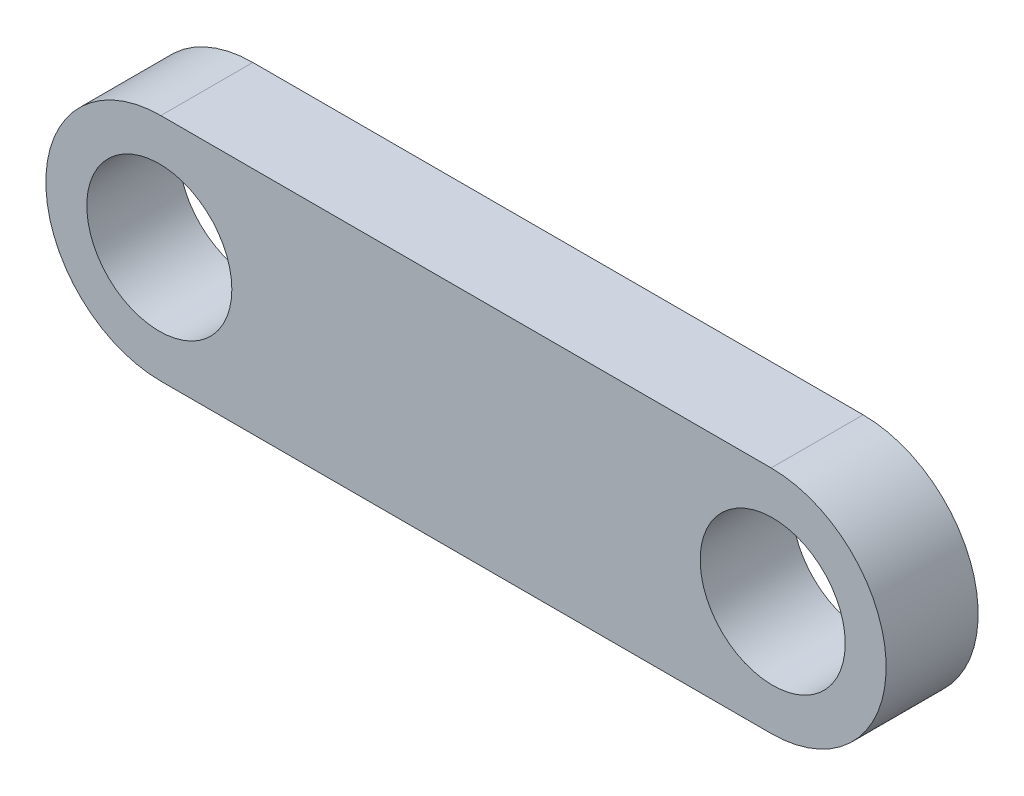
ISO-10303-21;
HEADER;
FILE_DESCRIPTION(('STEP AP214'),'2;1');
FILE_NAME('part.step','',(''),(''),'','','');
FILE_SCHEMA(('AUTOMOTIVE_DESIGN { 1 0 10303 214 1 1 1 1 }'));
ENDSEC;
DATA;
#1=APPLICATION_CONTEXT('core data for automotive mechanical design processes');
#2=APPLICATION_PROTOCOL_DEFINITION('international standard','automotive_design',2000,#1);
#3=PRODUCT_CONTEXT('',#1,'mechanical');
#4=PRODUCT('Part','Part','',(#3));
#5=PRODUCT_RELATED_PRODUCT_CATEGORY('part','',(#4));
#6=PRODUCT_DEFINITION_FORMATION('','',#4);
#7=PRODUCT_DEFINITION_CONTEXT('part definition',#1,'design');
#8=PRODUCT_DEFINITION('design','',#6,#7);
#9=PRODUCT_DEFINITION_SHAPE('','',#8);
#10=(LENGTH_UNIT() NAMED_UNIT(*) SI_UNIT(.MILLI.,.METRE.));
#11=(NAMED_UNIT(*) PLANE_ANGLE_UNIT() SI_UNIT($,.RADIAN.));
#12=(NAMED_UNIT(*) SI_UNIT($,.STERADIAN.) SOLID_ANGLE_UNIT());
#13=UNCERTAINTY_MEASURE_WITH_UNIT(LENGTH_MEASURE(1.E-05),#10,'distance_accuracy_value','');
#14=(GEOMETRIC_REPRESENTATION_CONTEXT(3) GLOBAL_UNCERTAINTY_ASSIGNED_CONTEXT((#13)) GLOBAL_UNIT_ASSIGNED_CONTEXT((#10,
#11,#12)) REPRESENTATION_CONTEXT('',''));
#15=CARTESIAN_POINT('',(0.,0.,0.));
#16=DIRECTION('',(0.,0.,1.));
#17=DIRECTION('',(1.,0.,0.));
#18=AXIS2_PLACEMENT_3D('',#15,#16,#17);
#19=CARTESIAN_POINT('',(0.049999999999998,-3.75,-28.4079214304743));
#20=DIRECTION('',(0.,-1.,0.));
#21=DIRECTION('',(0.,0.,-1.));
#22=AXIS2_PLACEMENT_3D('',#19,#20,#21);
#23=PLANE('',#22);
#24=DIRECTION('',(-1.,0.,0.));
#25=VECTOR('',#24,1.);
#26=CARTESIAN_POINT('',(0.049999999999998,-3.75,0.));
#27=LINE('',#26,#25);
#28=CARTESIAN_POINT('',(19.95,-3.75,0.));
#29=VERTEX_POINT('',#28);
#30=CARTESIAN_POINT('',(0.049999999999998,-3.75,0.));
#31=VERTEX_POINT('',#30);
#32=EDGE_CURVE('E121',#29,#31,#27,.T.);
#33=ORIENTED_EDGE('',*,*,#32,.F.);
#34=DIRECTION('',(0.,0.,1.));
#35=VECTOR('',#34,1.);
#36=CARTESIAN_POINT('',(19.95,-3.75,-28.4079214304743));
#37=LINE('',#36,#35);
#38=CARTESIAN_POINT('',(19.95,-3.75,3.));
#39=VERTEX_POINT('',#38);
#40=EDGE_CURVE('E87',#29,#39,#37,.T.);
#41=ORIENTED_EDGE('',*,*,#40,.T.);
#42=DIRECTION('',(1.,0.,0.));
#43=VECTOR('',#42,1.);
#44=CARTESIAN_POINT('',(0.049999999999998,-3.75,3.));
#45=LINE('',#44,#43);
#46=CARTESIAN_POINT('',(0.049999999999998,-3.75,3.));
#47=VERTEX_POINT('',#46);
#48=EDGE_CURVE('E90',#47,#39,#45,.T.);
#49=ORIENTED_EDGE('',*,*,#48,.F.);
#50=DIRECTION('',(0.,0.,1.));
#51=VECTOR('',#50,1.);
#52=CARTESIAN_POINT('',(0.049999999999998,-3.75,-28.4079214304743));
#53=LINE('',#52,#51);
#54=EDGE_CURVE('E78',#31,#47,#53,.T.);
#55=ORIENTED_EDGE('',*,*,#54,.F.);
#56=EDGE_LOOP('',(#33,#41,#49,#55));
#57=FACE_BOUND('',#56,.T.);
#58=ADVANCED_FACE('F40',(#57),#23,.T.);
#59=CARTESIAN_POINT('',(19.95,0.,-28.4079214304743));
#60=DIRECTION('',(0.,0.,1.));
#61=DIRECTION('',(1.,0.,0.));
#62=AXIS2_PLACEMENT_3D('',#59,#60,#61);
#63=CYLINDRICAL_SURFACE('',#62,3.75);
#64=CARTESIAN_POINT('',(19.95,0.,0.));
#65=DIRECTION('',(0.,0.,1.));
#66=DIRECTION('',(1.,0.,0.));
#67=AXIS2_PLACEMENT_3D('',#64,#65,#66);
#68=CIRCLE('',#67,3.75);
#69=CARTESIAN_POINT('',(19.95,3.75,0.));
#70=VERTEX_POINT('',#69);
#71=EDGE_CURVE('E110',#70,#29,#68,.F.);
#72=ORIENTED_EDGE('',*,*,#71,.F.);
#73=DIRECTION('',(0.,0.,1.));
#74=VECTOR('',#73,1.);
#75=CARTESIAN_POINT('',(19.95,3.75,-28.4079214304743));
#76=LINE('',#75,#74);
#77=CARTESIAN_POINT('',(19.95,3.75,3.));
#78=VERTEX_POINT('',#77);
#79=EDGE_CURVE('E111',#70,#78,#76,.T.);
#80=ORIENTED_EDGE('',*,*,#79,.T.);
#81=CARTESIAN_POINT('',(19.95,0.,3.));
#82=DIRECTION('',(0.,0.,1.));
#83=DIRECTION('',(1.,0.,0.));
#84=AXIS2_PLACEMENT_3D('',#81,#82,#83);
#85=CIRCLE('',#84,3.75);
#86=EDGE_CURVE('E95',#39,#78,#85,.T.);
#87=ORIENTED_EDGE('',*,*,#86,.F.);
#88=ORIENTED_EDGE('',*,*,#40,.F.);
#89=EDGE_LOOP('',(#72,#80,#87,#88));
#90=FACE_BOUND('',#89,.T.);
#91=ADVANCED_FACE('F116',(#90),#63,.T.);
#92=CARTESIAN_POINT('',(0.0499999999999987,3.75,-28.4079214304743));
#93=DIRECTION('',(0.,1.,0.));
#94=DIRECTION('',(0.,0.,1.));
#95=AXIS2_PLACEMENT_3D('',#92,#93,#94);
#96=PLANE('',#95);
#97=DIRECTION('',(1.,0.,0.));
#98=VECTOR('',#97,1.);
#99=CARTESIAN_POINT('',(0.0499999999999987,3.75,0.));
#100=LINE('',#99,#98);
#101=CARTESIAN_POINT('',(0.0499999999999987,3.75,0.));
#102=VERTEX_POINT('',#101);
#103=EDGE_CURVE('E119',#102,#70,#100,.T.);
#104=ORIENTED_EDGE('',*,*,#103,.F.);
#105=DIRECTION('',(0.,0.,1.));
#106=VECTOR('',#105,1.);
#107=CARTESIAN_POINT('',(0.0499999999999987,3.75,-28.4079214304743));
#108=LINE('',#107,#106);
#109=CARTESIAN_POINT('',(0.0499999999999987,3.75,3.));
#110=VERTEX_POINT('',#109);
#111=EDGE_CURVE('E108',#102,#110,#108,.T.);
#112=ORIENTED_EDGE('',*,*,#111,.T.);
#113=DIRECTION('',(-1.,0.,0.));
#114=VECTOR('',#113,1.);
#115=CARTESIAN_POINT('',(0.0499999999999987,3.75,3.));
#116=LINE('',#115,#114);
#117=EDGE_CURVE('E88',#78,#110,#116,.T.);
#118=ORIENTED_EDGE('',*,*,#117,.F.);
#119=ORIENTED_EDGE('',*,*,#79,.F.);
#120=EDGE_LOOP('',(#104,#112,#118,#119));
#121=FACE_BOUND('',#120,.T.);
#122=ADVANCED_FACE('F118',(#121),#96,.T.);
#123=CARTESIAN_POINT('',(0.0499999999999987,0.,-28.4079214304743));
#124=DIRECTION('',(0.,0.,1.));
#125=DIRECTION('',(1.,0.,0.));
#126=AXIS2_PLACEMENT_3D('',#123,#124,#125);
#127=CYLINDRICAL_SURFACE('',#126,3.75);
#128=CARTESIAN_POINT('',(0.0499999999999987,0.,0.));
#129=DIRECTION('',(0.,0.,1.));
#130=DIRECTION('',(1.,0.,0.));
#131=AXIS2_PLACEMENT_3D('',#128,#129,#130);
#132=CIRCLE('',#131,3.75);
#133=EDGE_CURVE('E58',#31,#102,#132,.F.);
#134=ORIENTED_EDGE('',*,*,#133,.F.);
#135=ORIENTED_EDGE('',*,*,#54,.T.);
#136=CARTESIAN_POINT('',(0.0499999999999987,0.,3.));
#137=DIRECTION('',(0.,0.,1.));
#138=DIRECTION('',(1.,0.,0.));
#139=AXIS2_PLACEMENT_3D('',#136,#137,#138);
#140=CIRCLE('',#139,3.75);
#141=EDGE_CURVE('E83',#110,#47,#140,.T.);
#142=ORIENTED_EDGE('',*,*,#141,.F.);
#143=ORIENTED_EDGE('',*,*,#111,.F.);
#144=EDGE_LOOP('',(#134,#135,#142,#143));
#145=FACE_BOUND('',#144,.T.);
#146=ADVANCED_FACE('F80',(#145),#127,.T.);
#147=CARTESIAN_POINT('',(0.,0.,0.));
#148=DIRECTION('',(0.,0.,1.));
#149=DIRECTION('',(1.,0.,0.));
#150=AXIS2_PLACEMENT_3D('',#147,#148,#149);
#151=PLANE('',#150);
#152=CARTESIAN_POINT('',(20.,0.,0.));
#153=DIRECTION('',(0.,0.,1.));
#154=DIRECTION('',(1.,0.,0.));
#155=AXIS2_PLACEMENT_3D('',#152,#153,#154);
#156=CIRCLE('',#155,2.365);
#157=CARTESIAN_POINT('',(22.365,0.,0.));
#158=VERTEX_POINT('',#157);
#159=EDGE_CURVE('E44',#158,#158,#156,.F.);
#160=ORIENTED_EDGE('',*,*,#159,.F.);
#161=EDGE_LOOP('',(#160));
#162=FACE_BOUND('',#161,.T.);
#163=CARTESIAN_POINT('',(0.,0.,0.));
#164=DIRECTION('',(0.,0.,1.));
#165=DIRECTION('',(1.,0.,0.));
#166=AXIS2_PLACEMENT_3D('',#163,#164,#165);
#167=CIRCLE('',#166,2.365);
#168=CARTESIAN_POINT('',(2.365,0.,0.));
#169=VERTEX_POINT('',#168);
#170=EDGE_CURVE('E11',#169,#169,#167,.F.);
#171=ORIENTED_EDGE('',*,*,#170,.F.);
#172=EDGE_LOOP('',(#171));
#173=FACE_BOUND('',#172,.T.);
#174=ORIENTED_EDGE('',*,*,#133,.T.);
#175=ORIENTED_EDGE('',*,*,#103,.T.);
#176=ORIENTED_EDGE('',*,*,#71,.T.);
#177=ORIENTED_EDGE('',*,*,#32,.T.);
#178=EDGE_LOOP('',(#174,#175,#176,#177));
#179=FACE_BOUND('',#178,.T.);
#180=ADVANCED_FACE('F42',(#162,#173,#179),#151,.F.);
#181=CARTESIAN_POINT('',(20.,0.,-28.4079214304743));
#182=DIRECTION('',(0.,0.,1.));
#183=DIRECTION('',(1.,0.,0.));
#184=AXIS2_PLACEMENT_3D('',#181,#182,#183);
#185=CYLINDRICAL_SURFACE('',#184,2.365);
#186=ORIENTED_EDGE('',*,*,#159,.T.);
#187=EDGE_LOOP('',(#186));
#188=FACE_BOUND('',#187,.T.);
#189=CARTESIAN_POINT('',(20.,0.,3.));
#190=DIRECTION('',(0.,0.,1.));
#191=DIRECTION('',(1.,0.,0.));
#192=AXIS2_PLACEMENT_3D('',#189,#190,#191);
#193=CIRCLE('',#192,2.365);
#194=CARTESIAN_POINT('',(22.365,0.,3.));
#195=VERTEX_POINT('',#194);
#196=EDGE_CURVE('E102',#195,#195,#193,.T.);
#197=ORIENTED_EDGE('',*,*,#196,.T.);
#198=EDGE_LOOP('',(#197));
#199=FACE_BOUND('',#198,.T.);
#200=ADVANCED_FACE('F128',(#188,#199),#185,.F.);
#201=CARTESIAN_POINT('',(0.,0.,3.));
#202=DIRECTION('',(0.,0.,1.));
#203=DIRECTION('',(1.,0.,0.));
#204=AXIS2_PLACEMENT_3D('',#201,#202,#203);
#205=PLANE('',#204);
#206=ORIENTED_EDGE('',*,*,#196,.F.);
#207=EDGE_LOOP('',(#206));
#208=FACE_BOUND('',#207,.T.);
#209=CARTESIAN_POINT('',(0.,0.,3.));
#210=DIRECTION('',(0.,0.,1.));
#211=DIRECTION('',(1.,0.,0.));
#212=AXIS2_PLACEMENT_3D('',#209,#210,#211);
#213=CIRCLE('',#212,2.365);
#214=CARTESIAN_POINT('',(2.365,0.,3.));
#215=VERTEX_POINT('',#214);
#216=EDGE_CURVE('E99',#215,#215,#213,.T.);
#217=ORIENTED_EDGE('',*,*,#216,.F.);
#218=EDGE_LOOP('',(#217));
#219=FACE_BOUND('',#218,.T.);
#220=ORIENTED_EDGE('',*,*,#141,.T.);
#221=ORIENTED_EDGE('',*,*,#48,.T.);
#222=ORIENTED_EDGE('',*,*,#86,.T.);
#223=ORIENTED_EDGE('',*,*,#117,.T.);
#224=EDGE_LOOP('',(#220,#221,#222,#223));
#225=FACE_BOUND('',#224,.T.);
#226=ADVANCED_FACE('F97',(#208,#219,#225),#205,.T.);
#227=CARTESIAN_POINT('',(0.,0.,-28.4079214304743));
#228=DIRECTION('',(0.,0.,1.));
#229=DIRECTION('',(1.,0.,0.));
#230=AXIS2_PLACEMENT_3D('',#227,#228,#229);
#231=CYLINDRICAL_SURFACE('',#230,2.365);
#232=ORIENTED_EDGE('',*,*,#170,.T.);
#233=EDGE_LOOP('',(#232));
#234=FACE_BOUND('',#233,.T.);
#235=ORIENTED_EDGE('',*,*,#216,.T.);
#236=EDGE_LOOP('',(#235));
#237=FACE_BOUND('',#236,.T.);
#238=ADVANCED_FACE('F132',(#234,#237),#231,.F.);
#239=CLOSED_SHELL('',(#58,#91,#122,#146,#180,#200,#226,#238));
#240=MANIFOLD_SOLID_BREP('B2',#239);
#241=ADVANCED_BREP_SHAPE_REPRESENTATION('',(#18,#240),#14);
#242=SHAPE_DEFINITION_REPRESENTATION(#9,#241);
ENDSEC;
END-ISO-10303-21;
